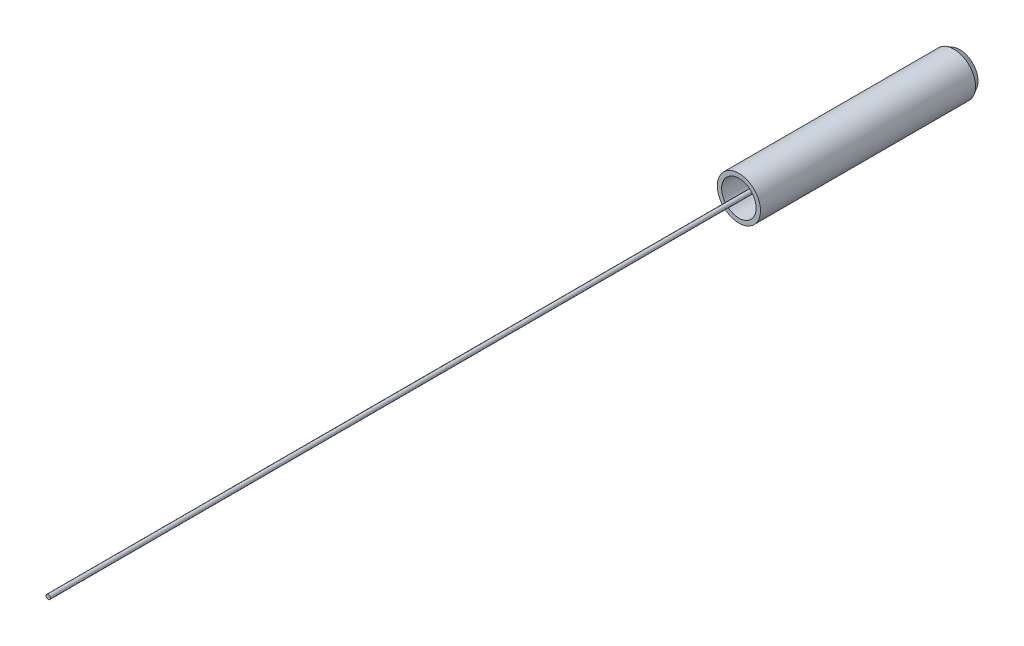
ISO-10303-21;
HEADER;
FILE_DESCRIPTION(('STEP AP214'),'2;1');
FILE_NAME('part.step','',(''),(''),'','','');
FILE_SCHEMA(('AUTOMOTIVE_DESIGN { 1 0 10303 214 1 1 1 1 }'));
ENDSEC;
DATA;
#1=APPLICATION_CONTEXT('core data for automotive mechanical design processes');
#2=APPLICATION_PROTOCOL_DEFINITION('international standard','automotive_design',2000,#1);
#3=PRODUCT_CONTEXT('',#1,'mechanical');
#4=PRODUCT('Part','Part','',(#3));
#5=PRODUCT_RELATED_PRODUCT_CATEGORY('part','',(#4));
#6=PRODUCT_DEFINITION_FORMATION('','',#4);
#7=PRODUCT_DEFINITION_CONTEXT('part definition',#1,'design');
#8=PRODUCT_DEFINITION('design','',#6,#7);
#9=PRODUCT_DEFINITION_SHAPE('','',#8);
#10=(LENGTH_UNIT() NAMED_UNIT(*) SI_UNIT(.MILLI.,.METRE.));
#11=(NAMED_UNIT(*) PLANE_ANGLE_UNIT() SI_UNIT($,.RADIAN.));
#12=(NAMED_UNIT(*) SI_UNIT($,.STERADIAN.) SOLID_ANGLE_UNIT());
#13=UNCERTAINTY_MEASURE_WITH_UNIT(LENGTH_MEASURE(1.E-05),#10,'distance_accuracy_value','');
#14=(GEOMETRIC_REPRESENTATION_CONTEXT(3) GLOBAL_UNCERTAINTY_ASSIGNED_CONTEXT((#13)) GLOBAL_UNIT_ASSIGNED_CONTEXT((#10,
#11,#12)) REPRESENTATION_CONTEXT('',''));
#15=CARTESIAN_POINT('',(0.,0.,0.));
#16=DIRECTION('',(0.,0.,1.));
#17=DIRECTION('',(1.,0.,0.));
#18=AXIS2_PLACEMENT_3D('',#15,#16,#17);
#19=CARTESIAN_POINT('',(-42.8081530503164,13.8041898533743,10.010916070534));
#20=DIRECTION('',(0.,0.,1.));
#21=DIRECTION('',(1.,0.,0.));
#22=AXIS2_PLACEMENT_3D('',#19,#20,#21);
#23=CYLINDRICAL_SURFACE('',#22,0.0625);
#24=CARTESIAN_POINT('',(-42.8081530503164,13.8041898533743,10.010916070534));
#25=DIRECTION('',(0.,0.,1.));
#26=DIRECTION('',(1.,0.,0.));
#27=AXIS2_PLACEMENT_3D('',#24,#25,#26);
#28=CIRCLE('',#27,0.0625);
#29=CARTESIAN_POINT('',(-42.7456530503164,13.8041898533743,10.010916070534));
#30=VERTEX_POINT('',#29);
#31=EDGE_CURVE('P0_E10',#30,#30,#28,.T.);
#32=ORIENTED_EDGE('',*,*,#31,.T.);
#33=EDGE_LOOP('',(#32));
#34=FACE_BOUND('',#33,.T.);
#35=CARTESIAN_POINT('',(-42.8081530503164,13.8041898533743,36.410916070534));
#36=DIRECTION('',(0.,0.,1.));
#37=DIRECTION('',(1.,0.,0.));
#38=AXIS2_PLACEMENT_3D('',#35,#36,#37);
#39=CIRCLE('',#38,0.0625);
#40=CARTESIAN_POINT('',(-42.7456530503164,13.8041898533743,36.410916070534));
#41=VERTEX_POINT('',#40);
#42=EDGE_CURVE('P0_E17',#41,#41,#39,.T.);
#43=ORIENTED_EDGE('',*,*,#42,.F.);
#44=EDGE_LOOP('',(#43));
#45=FACE_BOUND('',#44,.T.);
#46=ADVANCED_FACE('P0_F14',(#34,#45),#23,.T.);
#47=CARTESIAN_POINT('',(-42.8081530503164,13.8041898533743,10.010916070534));
#48=DIRECTION('',(0.,0.,1.));
#49=DIRECTION('',(1.,0.,0.));
#50=AXIS2_PLACEMENT_3D('',#47,#48,#49);
#51=PLANE('',#50);
#52=ORIENTED_EDGE('',*,*,#31,.F.);
#53=EDGE_LOOP('',(#52));
#54=FACE_BOUND('',#53,.T.);
#55=ADVANCED_FACE('P0_F29',(#54),#51,.F.);
#56=CARTESIAN_POINT('',(-42.8081530503164,13.8041898533743,36.410916070534));
#57=DIRECTION('',(0.,0.,1.));
#58=DIRECTION('',(1.,0.,0.));
#59=AXIS2_PLACEMENT_3D('',#56,#57,#58);
#60=PLANE('',#59);
#61=ORIENTED_EDGE('',*,*,#42,.T.);
#62=EDGE_LOOP('',(#61));
#63=FACE_BOUND('',#62,.T.);
#64=ADVANCED_FACE('P0_F26',(#63),#60,.T.);
#65=CLOSED_SHELL('',(#46,#55,#64));
#66=MANIFOLD_SOLID_BREP('P0_B1',#65);
#67=CARTESIAN_POINT('',(-42.8081530503164,13.8041898533743,10.010916070534));
#68=DIRECTION('',(0.,0.,1.));
#69=DIRECTION('',(1.,0.,0.));
#70=AXIS2_PLACEMENT_3D('',#67,#68,#69);
#71=CYLINDRICAL_SURFACE('',#70,0.6245);
#72=CARTESIAN_POINT('',(-42.8081530503164,13.8041898533743,10.1841211512909));
#73=DIRECTION('',(0.,0.,-1.));
#74=DIRECTION('',(-1.,0.,0.));
#75=AXIS2_PLACEMENT_3D('',#72,#73,#74);
#76=CIRCLE('',#75,0.6245);
#77=CARTESIAN_POINT('',(-43.4326530503164,13.8041898533743,10.1841211512909));
#78=VERTEX_POINT('',#77);
#79=EDGE_CURVE('P1_E38',#78,#78,#76,.T.);
#80=ORIENTED_EDGE('',*,*,#79,.F.);
#81=EDGE_LOOP('',(#80));
#82=FACE_BOUND('',#81,.T.);
#83=CARTESIAN_POINT('',(-42.8081530503164,13.8041898533743,16.410916070534));
#84=DIRECTION('',(0.,0.,1.));
#85=DIRECTION('',(1.,0.,0.));
#86=AXIS2_PLACEMENT_3D('',#83,#84,#85);
#87=CIRCLE('',#86,0.6245);
#88=CARTESIAN_POINT('',(-42.1836530503164,13.8041898533743,16.410916070534));
#89=VERTEX_POINT('',#88);
#90=EDGE_CURVE('P1_E9',#89,#89,#87,.T.);
#91=ORIENTED_EDGE('',*,*,#90,.F.);
#92=EDGE_LOOP('',(#91));
#93=FACE_BOUND('',#92,.T.);
#94=ADVANCED_FACE('P1_F13',(#82,#93),#71,.T.);
#95=CARTESIAN_POINT('',(-42.8081530503164,13.8041898533743,10.010916070534));
#96=DIRECTION('',(0.,0.,1.));
#97=DIRECTION('',(1.,0.,0.));
#98=AXIS2_PLACEMENT_3D('',#95,#96,#97);
#99=PLANE('',#98);
#100=CARTESIAN_POINT('',(-42.8081530503164,13.8041898533743,10.010916070534));
#101=DIRECTION('',(0.,0.,-1.));
#102=DIRECTION('',(-1.,0.,0.));
#103=AXIS2_PLACEMENT_3D('',#100,#101,#102);
#104=CIRCLE('',#103,0.5245);
#105=CARTESIAN_POINT('',(-43.3326530503164,13.8041898533743,10.010916070534));
#106=VERTEX_POINT('',#105);
#107=EDGE_CURVE('P1_E35',#106,#106,#104,.T.);
#108=ORIENTED_EDGE('',*,*,#107,.T.);
#109=EDGE_LOOP('',(#108));
#110=FACE_BOUND('',#109,.T.);
#111=CARTESIAN_POINT('',(-42.8081530503164,13.8041898533743,10.010916070534));
#112=DIRECTION('',(0.,0.,1.));
#113=DIRECTION('',(1.,0.,0.));
#114=AXIS2_PLACEMENT_3D('',#111,#112,#113);
#115=CIRCLE('',#114,0.063);
#116=CARTESIAN_POINT('',(-42.7451530503164,13.8041898533743,10.010916070534));
#117=VERTEX_POINT('',#116);
#118=EDGE_CURVE('P1_E20',#117,#117,#115,.T.);
#119=ORIENTED_EDGE('',*,*,#118,.T.);
#120=EDGE_LOOP('',(#119));
#121=FACE_BOUND('',#120,.T.);
#122=ADVANCED_FACE('P1_F46',(#110,#121),#99,.F.);
#123=CARTESIAN_POINT('',(-42.8081530503164,13.8041898533743,16.410916070534));
#124=DIRECTION('',(0.,0.,1.));
#125=DIRECTION('',(1.,0.,0.));
#126=AXIS2_PLACEMENT_3D('',#123,#124,#125);
#127=PLANE('',#126);
#128=CARTESIAN_POINT('',(-42.8081530503164,13.8041898533743,16.410916070534));
#129=DIRECTION('',(0.,0.,-1.));
#130=DIRECTION('',(-1.,0.,0.));
#131=AXIS2_PLACEMENT_3D('',#128,#129,#130);
#132=CIRCLE('',#131,0.5);
#133=CARTESIAN_POINT('',(-43.3081530503164,13.8041898533743,16.410916070534));
#134=VERTEX_POINT('',#133);
#135=EDGE_CURVE('P1_E26',#134,#134,#132,.T.);
#136=ORIENTED_EDGE('',*,*,#135,.T.);
#137=EDGE_LOOP('',(#136));
#138=FACE_BOUND('',#137,.T.);
#139=ORIENTED_EDGE('',*,*,#90,.T.);
#140=EDGE_LOOP('',(#139));
#141=FACE_BOUND('',#140,.T.);
#142=ADVANCED_FACE('P1_F51',(#138,#141),#127,.T.);
#143=CARTESIAN_POINT('',(-42.8081530503164,13.8041898533743,10.010916070534));
#144=DIRECTION('',(0.,0.,1.));
#145=DIRECTION('',(1.,0.,0.));
#146=AXIS2_PLACEMENT_3D('',#143,#144,#145);
#147=CYLINDRICAL_SURFACE('',#146,0.063);
#148=CARTESIAN_POINT('',(-42.8081530503164,13.8041898533743,10.323916070534));
#149=DIRECTION('',(0.,0.,1.));
#150=DIRECTION('',(1.,0.,0.));
#151=AXIS2_PLACEMENT_3D('',#148,#149,#150);
#152=CIRCLE('',#151,0.063);
#153=CARTESIAN_POINT('',(-42.7451530503164,13.8041898533743,10.323916070534));
#154=VERTEX_POINT('',#153);
#155=EDGE_CURVE('P1_E16',#154,#154,#152,.T.);
#156=ORIENTED_EDGE('',*,*,#155,.T.);
#157=EDGE_LOOP('',(#156));
#158=FACE_BOUND('',#157,.T.);
#159=ORIENTED_EDGE('',*,*,#118,.F.);
#160=EDGE_LOOP('',(#159));
#161=FACE_BOUND('',#160,.T.);
#162=ADVANCED_FACE('P1_F57',(#158,#161),#147,.F.);
#163=CARTESIAN_POINT('',(-42.8081530503164,13.8041898533743,10.260916070534));
#164=DIRECTION('',(0.,0.,1.));
#165=DIRECTION('',(1.,0.,0.));
#166=AXIS2_PLACEMENT_3D('',#163,#164,#165);
#167=CONICAL_SURFACE('',#166,0.,0.78539816339745);
#168=CARTESIAN_POINT('',(-42.8081530503164,13.8041898533743,10.6144694611273));
#169=DIRECTION('',(0.,0.,-1.));
#170=DIRECTION('',(-1.,0.,0.));
#171=AXIS2_PLACEMENT_3D('',#168,#169,#170);
#172=CIRCLE('',#171,0.353553390593273);
#173=CARTESIAN_POINT('',(-43.1617064409096,13.8041898533743,10.6144694611273));
#174=VERTEX_POINT('',#173);
#175=EDGE_CURVE('P1_E29',#174,#174,#172,.T.);
#176=ORIENTED_EDGE('',*,*,#175,.F.);
#177=EDGE_LOOP('',(#176));
#178=FACE_BOUND('',#177,.T.);
#179=ORIENTED_EDGE('',*,*,#155,.F.);
#180=EDGE_LOOP('',(#179));
#181=FACE_BOUND('',#180,.T.);
#182=ADVANCED_FACE('P1_F63',(#178,#181),#167,.F.);
#183=CARTESIAN_POINT('',(-42.8081530503164,13.8041898533743,4.75591607053404));
#184=DIRECTION('',(0.,0.,-1.));
#185=DIRECTION('',(-1.,0.,0.));
#186=AXIS2_PLACEMENT_3D('',#183,#184,#185);
#187=CYLINDRICAL_SURFACE('',#186,0.5);
#188=ORIENTED_EDGE('',*,*,#135,.F.);
#189=EDGE_LOOP('',(#188));
#190=FACE_BOUND('',#189,.T.);
#191=CARTESIAN_POINT('',(-42.8081530503164,13.8041898533743,10.9680228517206));
#192=DIRECTION('',(0.,0.,-1.));
#193=DIRECTION('',(-1.,0.,0.));
#194=AXIS2_PLACEMENT_3D('',#191,#192,#193);
#195=CIRCLE('',#194,0.5);
#196=CARTESIAN_POINT('',(-43.3081530503164,13.8041898533743,10.9680228517206));
#197=VERTEX_POINT('',#196);
#198=EDGE_CURVE('P1_E32',#197,#197,#195,.T.);
#199=ORIENTED_EDGE('',*,*,#198,.T.);
#200=EDGE_LOOP('',(#199));
#201=FACE_BOUND('',#200,.T.);
#202=ADVANCED_FACE('P1_F65',(#190,#201),#187,.F.);
#203=CARTESIAN_POINT('',(-42.8081530503164,13.8041898533743,10.9680228517206));
#204=DIRECTION('',(0.,0.,-1.));
#205=DIRECTION('',(0.,1.,0.));
#206=AXIS2_PLACEMENT_3D('',#203,#204,#205);
#207=SPHERICAL_SURFACE('',#206,0.5);
#208=ORIENTED_EDGE('',*,*,#198,.F.);
#209=EDGE_LOOP('',(#208));
#210=FACE_BOUND('',#209,.T.);
#211=ORIENTED_EDGE('',*,*,#175,.T.);
#212=EDGE_LOOP('',(#211));
#213=FACE_BOUND('',#212,.T.);
#214=ADVANCED_FACE('P1_F68',(#210,#213),#207,.F.);
#215=CARTESIAN_POINT('',(-42.8081530503164,13.8041898533743,10.1841211512909));
#216=DIRECTION('',(0.,0.,1.));
#217=DIRECTION('',(1.,0.,0.));
#218=AXIS2_PLACEMENT_3D('',#215,#216,#217);
#219=CONICAL_SURFACE('',#218,0.6245,0.523598775598304);
#220=ORIENTED_EDGE('',*,*,#107,.F.);
#221=EDGE_LOOP('',(#220));
#222=FACE_BOUND('',#221,.T.);
#223=ORIENTED_EDGE('',*,*,#79,.T.);
#224=EDGE_LOOP('',(#223));
#225=FACE_BOUND('',#224,.T.);
#226=ADVANCED_FACE('P1_F42',(#222,#225),#219,.T.);
#227=CLOSED_SHELL('',(#94,#122,#142,#162,#182,#202,#214,#226));
#228=MANIFOLD_SOLID_BREP('P1_B1',#227);
#229=ADVANCED_BREP_SHAPE_REPRESENTATION('',(#18,#66,#228),#14);
#230=SHAPE_DEFINITION_REPRESENTATION(#9,#229);
ENDSEC;
END-ISO-10303-21;
